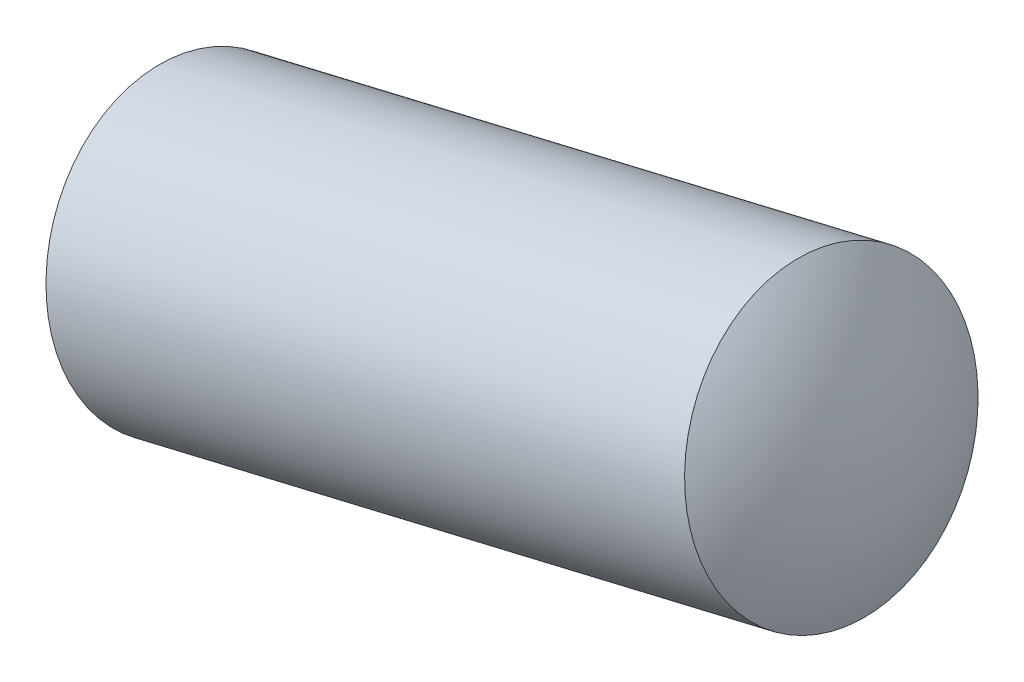
ISO-10303-21;
HEADER;
FILE_DESCRIPTION(('STEP AP214'),'2;1');
FILE_NAME('part.step','',(''),(''),'','','');
FILE_SCHEMA(('AUTOMOTIVE_DESIGN { 1 0 10303 214 1 1 1 1 }'));
ENDSEC;
DATA;
#1=APPLICATION_CONTEXT('core data for automotive mechanical design processes');
#2=APPLICATION_PROTOCOL_DEFINITION('international standard','automotive_design',2000,#1);
#3=PRODUCT_CONTEXT('',#1,'mechanical');
#4=PRODUCT('Part','Part','',(#3));
#5=PRODUCT_RELATED_PRODUCT_CATEGORY('part','',(#4));
#6=PRODUCT_DEFINITION_FORMATION('','',#4);
#7=PRODUCT_DEFINITION_CONTEXT('part definition',#1,'design');
#8=PRODUCT_DEFINITION('design','',#6,#7);
#9=PRODUCT_DEFINITION_SHAPE('','',#8);
#10=(LENGTH_UNIT() NAMED_UNIT(*) SI_UNIT(.MILLI.,.METRE.));
#11=(NAMED_UNIT(*) PLANE_ANGLE_UNIT() SI_UNIT($,.RADIAN.));
#12=(NAMED_UNIT(*) SI_UNIT($,.STERADIAN.) SOLID_ANGLE_UNIT());
#13=UNCERTAINTY_MEASURE_WITH_UNIT(LENGTH_MEASURE(1.E-05),#10,'distance_accuracy_value','');
#14=(GEOMETRIC_REPRESENTATION_CONTEXT(3) GLOBAL_UNCERTAINTY_ASSIGNED_CONTEXT((#13)) GLOBAL_UNIT_ASSIGNED_CONTEXT((#10,
#11,#12)) REPRESENTATION_CONTEXT('',''));
#15=CARTESIAN_POINT('',(0.,0.,0.));
#16=DIRECTION('',(0.,0.,1.));
#17=DIRECTION('',(1.,0.,0.));
#18=AXIS2_PLACEMENT_3D('',#15,#16,#17);
#19=CARTESIAN_POINT('',(21.7108168246094,5.14860509966253,0.6));
#20=DIRECTION('',(0.230745163055767,-0.973014218666083,0.));
#21=DIRECTION('',(0.973014218666083,0.230745163055767,0.));
#22=AXIS2_PLACEMENT_3D('',#19,#20,#21);
#23=SPHERICAL_SURFACE('',#22,2.);
#24=CARTESIAN_POINT('',(21.7108168246094,5.14860509966253,0.6));
#25=DIRECTION('',(-0.973014218666083,-0.230745163055767,0.));
#26=DIRECTION('',(0.,0.,-1.));
#27=AXIS2_PLACEMENT_3D('',#24,#25,#26);
#28=SPHERICAL_SURFACE('',#27,2.);
#29=CARTESIAN_POINT('',(23.396126887826,5.54826744567594,0.6));
#30=DIRECTION('',(-0.973014218666083,-0.230745163055767,0.));
#31=DIRECTION('',(0.,0.,-1.));
#32=AXIS2_PLACEMENT_3D('',#29,#30,#31);
#33=CIRCLE('',#32,1.);
#34=CARTESIAN_POINT('',(23.396126887826,5.54826744567594,-0.4));
#35=VERTEX_POINT('',#34);
#36=EDGE_CURVE('E11',#35,#35,#33,.T.);
#37=ORIENTED_EDGE('',*,*,#36,.F.);
#38=EDGE_LOOP('',(#37));
#39=FACE_BOUND('',#38,.T.);
#40=ADVANCED_FACE('F17',(#39),#28,.T.);
#41=CARTESIAN_POINT('',(20.6153016873653,4.88880949326331,0.599999999999989));
#42=DIRECTION('',(0.230745163055767,-0.973014218666083,0.));
#43=DIRECTION('',(-0.973014218666083,-0.230745163055767,0.));
#44=AXIS2_PLACEMENT_3D('',#41,#42,#43);
#45=SPHERICAL_SURFACE('',#44,2.);
#46=CARTESIAN_POINT('',(20.6153016873653,4.88880949326331,0.599999999999989));
#47=DIRECTION('',(-0.973014218666083,-0.230745163055767,0.));
#48=DIRECTION('',(0.,0.,-1.));
#49=AXIS2_PLACEMENT_3D('',#46,#47,#48);
#50=SPHERICAL_SURFACE('',#49,2.);
#51=CARTESIAN_POINT('',(18.9299916241487,4.48914714725001,0.6));
#52=DIRECTION('',(-0.973014218666083,-0.230745163055767,0.));
#53=DIRECTION('',(0.,0.,-1.));
#54=AXIS2_PLACEMENT_3D('',#51,#52,#53);
#55=CIRCLE('',#54,1.);
#56=CARTESIAN_POINT('',(18.9299916241487,4.48914714725001,-0.4));
#57=VERTEX_POINT('',#56);
#58=EDGE_CURVE('E21',#57,#57,#55,.T.);
#59=ORIENTED_EDGE('',*,*,#58,.T.);
#60=EDGE_LOOP('',(#59));
#61=FACE_BOUND('',#60,.T.);
#62=ADVANCED_FACE('F19',(#61),#50,.T.);
#63=CARTESIAN_POINT('',(20.046525440068,4.75392722185641,0.6));
#64=DIRECTION('',(-0.973014218666083,-0.230745163055767,0.));
#65=DIRECTION('',(0.,0.,-1.));
#66=AXIS2_PLACEMENT_3D('',#63,#64,#65);
#67=CYLINDRICAL_SURFACE('',#66,1.);
#68=ORIENTED_EDGE('',*,*,#36,.T.);
#69=EDGE_LOOP('',(#68));
#70=FACE_BOUND('',#69,.T.);
#71=ORIENTED_EDGE('',*,*,#58,.F.);
#72=EDGE_LOOP('',(#71));
#73=FACE_BOUND('',#72,.T.);
#74=ADVANCED_FACE('F57',(#70,#73),#67,.T.);
#75=CLOSED_SHELL('',(#40,#62,#74));
#76=MANIFOLD_SOLID_BREP('B1',#75);
#77=ADVANCED_BREP_SHAPE_REPRESENTATION('',(#18,#76),#14);
#78=SHAPE_DEFINITION_REPRESENTATION(#9,#77);
ENDSEC;
END-ISO-10303-21;
